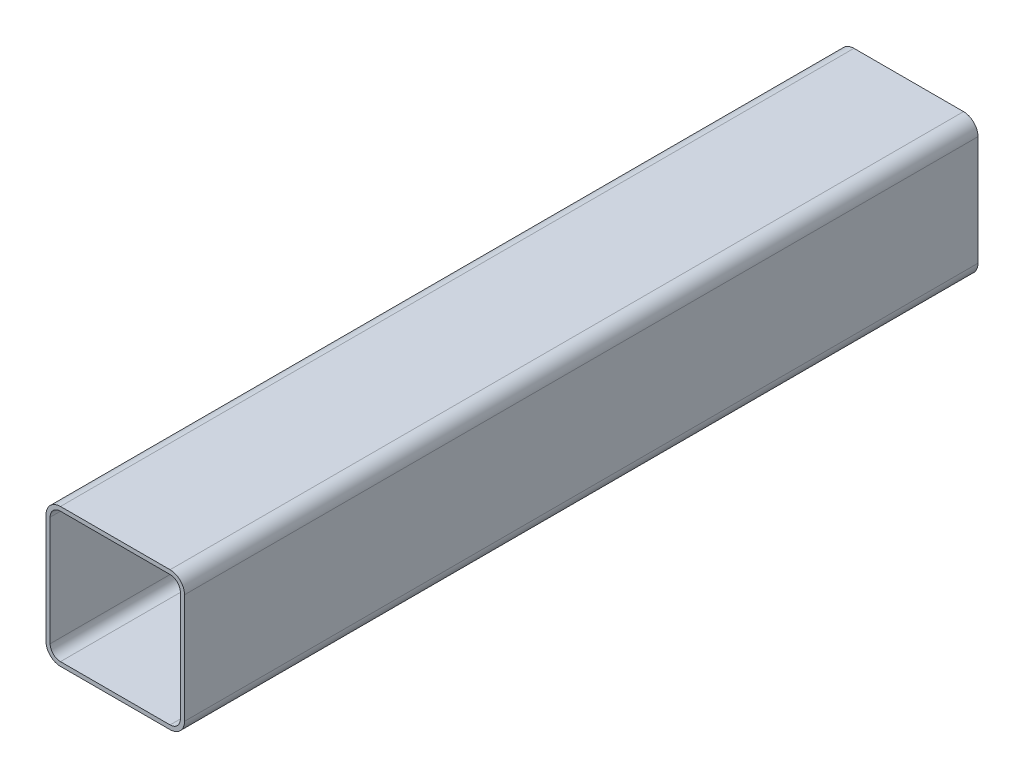
ISO-10303-21;
HEADER;
FILE_DESCRIPTION(('STEP AP214'),'2;1');
FILE_NAME('part.step','',(''),(''),'','','');
FILE_SCHEMA(('AUTOMOTIVE_DESIGN { 1 0 10303 214 1 1 1 1 }'));
ENDSEC;
DATA;
#1=APPLICATION_CONTEXT('core data for automotive mechanical design processes');
#2=APPLICATION_PROTOCOL_DEFINITION('international standard','automotive_design',2000,#1);
#3=PRODUCT_CONTEXT('',#1,'mechanical');
#4=PRODUCT('Part','Part','',(#3));
#5=PRODUCT_RELATED_PRODUCT_CATEGORY('part','',(#4));
#6=PRODUCT_DEFINITION_FORMATION('','',#4);
#7=PRODUCT_DEFINITION_CONTEXT('part definition',#1,'design');
#8=PRODUCT_DEFINITION('design','',#6,#7);
#9=PRODUCT_DEFINITION_SHAPE('','',#8);
#10=(LENGTH_UNIT() NAMED_UNIT(*) SI_UNIT(.MILLI.,.METRE.));
#11=(NAMED_UNIT(*) PLANE_ANGLE_UNIT() SI_UNIT($,.RADIAN.));
#12=(NAMED_UNIT(*) SI_UNIT($,.STERADIAN.) SOLID_ANGLE_UNIT());
#13=UNCERTAINTY_MEASURE_WITH_UNIT(LENGTH_MEASURE(1.E-05),#10,'distance_accuracy_value','');
#14=(GEOMETRIC_REPRESENTATION_CONTEXT(3) GLOBAL_UNCERTAINTY_ASSIGNED_CONTEXT((#13)) GLOBAL_UNIT_ASSIGNED_CONTEXT((#10,
#11,#12)) REPRESENTATION_CONTEXT('',''));
#15=CARTESIAN_POINT('',(0.,0.,0.));
#16=DIRECTION('',(0.,0.,1.));
#17=DIRECTION('',(1.,0.,0.));
#18=AXIS2_PLACEMENT_3D('',#15,#16,#17);
#19=CARTESIAN_POINT('',(-26.6065,-21.05025,152.4));
#20=DIRECTION('',(1.,0.,0.));
#21=DIRECTION('',(0.,0.,-1.));
#22=AXIS2_PLACEMENT_3D('',#19,#20,#21);
#23=PLANE('',#22);
#24=DIRECTION('',(0.,0.,-1.));
#25=VECTOR('',#24,1.);
#26=CARTESIAN_POINT('',(-26.6065,-21.05025,152.4));
#27=LINE('',#26,#25);
#28=CARTESIAN_POINT('',(-26.6065,-21.05025,152.4));
#29=VERTEX_POINT('',#28);
#30=CARTESIAN_POINT('',(-26.6065,-21.05025,-152.4));
#31=VERTEX_POINT('',#30);
#32=EDGE_CURVE('E156',#29,#31,#27,.T.);
#33=ORIENTED_EDGE('',*,*,#32,.F.);
#34=DIRECTION('',(0.,1.,0.));
#35=VECTOR('',#34,1.);
#36=CARTESIAN_POINT('',(-26.6065,21.05025,152.4));
#37=LINE('',#36,#35);
#38=CARTESIAN_POINT('',(-26.6065,21.05025,152.4));
#39=VERTEX_POINT('',#38);
#40=EDGE_CURVE('E116',#39,#29,#37,.F.);
#41=ORIENTED_EDGE('',*,*,#40,.F.);
#42=DIRECTION('',(0.,0.,-1.));
#43=VECTOR('',#42,1.);
#44=CARTESIAN_POINT('',(-26.6065,21.05025,152.4));
#45=LINE('',#44,#43);
#46=CARTESIAN_POINT('',(-26.6065,21.05025,-152.4));
#47=VERTEX_POINT('',#46);
#48=EDGE_CURVE('E159',#47,#39,#45,.F.);
#49=ORIENTED_EDGE('',*,*,#48,.F.);
#50=DIRECTION('',(0.,1.,0.));
#51=VECTOR('',#50,1.);
#52=CARTESIAN_POINT('',(-26.6065,21.05025,-152.4));
#53=LINE('',#52,#51);
#54=EDGE_CURVE('E188',#47,#31,#53,.F.);
#55=ORIENTED_EDGE('',*,*,#54,.T.);
#56=EDGE_LOOP('',(#33,#41,#49,#55));
#57=FACE_BOUND('',#56,.T.);
#58=ADVANCED_FACE('F15',(#57),#23,.F.);
#59=CARTESIAN_POINT('',(-21.05025,-21.05025,152.4));
#60=DIRECTION('',(0.,0.,-1.));
#61=DIRECTION('',(-1.,0.,0.));
#62=AXIS2_PLACEMENT_3D('',#59,#60,#61);
#63=CYLINDRICAL_SURFACE('',#62,5.55625);
#64=CARTESIAN_POINT('',(-21.05025,-21.05025,152.4));
#65=DIRECTION('',(0.,0.,-1.));
#66=DIRECTION('',(-1.,0.,0.));
#67=AXIS2_PLACEMENT_3D('',#64,#65,#66);
#68=CIRCLE('',#67,5.55625);
#69=CARTESIAN_POINT('',(-21.05025,-26.6065,152.4));
#70=VERTEX_POINT('',#69);
#71=EDGE_CURVE('E117',#29,#70,#68,.F.);
#72=ORIENTED_EDGE('',*,*,#71,.F.);
#73=ORIENTED_EDGE('',*,*,#32,.T.);
#74=CARTESIAN_POINT('',(-21.05025,-21.05025,-152.4));
#75=DIRECTION('',(0.,0.,-1.));
#76=DIRECTION('',(-1.,0.,0.));
#77=AXIS2_PLACEMENT_3D('',#74,#75,#76);
#78=CIRCLE('',#77,5.55625);
#79=CARTESIAN_POINT('',(-21.05025,-26.6065,-152.4));
#80=VERTEX_POINT('',#79);
#81=EDGE_CURVE('E185',#31,#80,#78,.F.);
#82=ORIENTED_EDGE('',*,*,#81,.T.);
#83=DIRECTION('',(0.,0.,1.));
#84=VECTOR('',#83,1.);
#85=CARTESIAN_POINT('',(-21.05025,-26.6065,152.4));
#86=LINE('',#85,#84);
#87=EDGE_CURVE('E153',#80,#70,#86,.T.);
#88=ORIENTED_EDGE('',*,*,#87,.T.);
#89=EDGE_LOOP('',(#72,#73,#82,#88));
#90=FACE_BOUND('',#89,.T.);
#91=ADVANCED_FACE('F277',(#90),#63,.T.);
#92=CARTESIAN_POINT('',(-21.05025,-26.6065,152.4));
#93=DIRECTION('',(0.,1.,0.));
#94=DIRECTION('',(0.,0.,1.));
#95=AXIS2_PLACEMENT_3D('',#92,#93,#94);
#96=PLANE('',#95);
#97=DIRECTION('',(0.,0.,-1.));
#98=VECTOR('',#97,1.);
#99=CARTESIAN_POINT('',(21.05025,-26.6065,152.4));
#100=LINE('',#99,#98);
#101=CARTESIAN_POINT('',(21.05025,-26.6065,152.4));
#102=VERTEX_POINT('',#101);
#103=CARTESIAN_POINT('',(21.05025,-26.6065,-152.4));
#104=VERTEX_POINT('',#103);
#105=EDGE_CURVE('E150',#102,#104,#100,.T.);
#106=ORIENTED_EDGE('',*,*,#105,.F.);
#107=DIRECTION('',(1.,0.,0.));
#108=VECTOR('',#107,1.);
#109=CARTESIAN_POINT('',(21.05025,-26.6065,152.4));
#110=LINE('',#109,#108);
#111=EDGE_CURVE('E122',#70,#102,#110,.T.);
#112=ORIENTED_EDGE('',*,*,#111,.F.);
#113=ORIENTED_EDGE('',*,*,#87,.F.);
#114=DIRECTION('',(1.,0.,0.));
#115=VECTOR('',#114,1.);
#116=CARTESIAN_POINT('',(21.05025,-26.6065,-152.4));
#117=LINE('',#116,#115);
#118=EDGE_CURVE('E184',#80,#104,#117,.T.);
#119=ORIENTED_EDGE('',*,*,#118,.T.);
#120=EDGE_LOOP('',(#106,#112,#113,#119));
#121=FACE_BOUND('',#120,.T.);
#122=ADVANCED_FACE('F209',(#121),#96,.F.);
#123=CARTESIAN_POINT('',(21.05025,-21.05025,152.4));
#124=DIRECTION('',(0.,0.,-1.));
#125=DIRECTION('',(-1.,0.,0.));
#126=AXIS2_PLACEMENT_3D('',#123,#124,#125);
#127=CYLINDRICAL_SURFACE('',#126,5.55625);
#128=CARTESIAN_POINT('',(21.05025,-21.05025,152.4));
#129=DIRECTION('',(0.,0.,-1.));
#130=DIRECTION('',(-1.,0.,0.));
#131=AXIS2_PLACEMENT_3D('',#128,#129,#130);
#132=CIRCLE('',#131,5.55625);
#133=CARTESIAN_POINT('',(26.6065,-21.05025,152.4));
#134=VERTEX_POINT('',#133);
#135=EDGE_CURVE('E108',#102,#134,#132,.F.);
#136=ORIENTED_EDGE('',*,*,#135,.F.);
#137=ORIENTED_EDGE('',*,*,#105,.T.);
#138=CARTESIAN_POINT('',(21.05025,-21.05025,-152.4));
#139=DIRECTION('',(0.,0.,-1.));
#140=DIRECTION('',(-1.,0.,0.));
#141=AXIS2_PLACEMENT_3D('',#138,#139,#140);
#142=CIRCLE('',#141,5.55625);
#143=CARTESIAN_POINT('',(26.6065,-21.05025,-152.4));
#144=VERTEX_POINT('',#143);
#145=EDGE_CURVE('E181',#104,#144,#142,.F.);
#146=ORIENTED_EDGE('',*,*,#145,.T.);
#147=DIRECTION('',(0.,0.,1.));
#148=VECTOR('',#147,1.);
#149=CARTESIAN_POINT('',(26.6065,-21.05025,152.4));
#150=LINE('',#149,#148);
#151=EDGE_CURVE('E147',#144,#134,#150,.T.);
#152=ORIENTED_EDGE('',*,*,#151,.T.);
#153=EDGE_LOOP('',(#136,#137,#146,#152));
#154=FACE_BOUND('',#153,.T.);
#155=ADVANCED_FACE('F214',(#154),#127,.T.);
#156=CARTESIAN_POINT('',(26.6065,21.05025,152.4));
#157=DIRECTION('',(-1.,0.,0.));
#158=DIRECTION('',(0.,0.,1.));
#159=AXIS2_PLACEMENT_3D('',#156,#157,#158);
#160=PLANE('',#159);
#161=DIRECTION('',(0.,0.,-1.));
#162=VECTOR('',#161,1.);
#163=CARTESIAN_POINT('',(26.6065,21.05025,152.4));
#164=LINE('',#163,#162);
#165=CARTESIAN_POINT('',(26.6065,21.05025,152.4));
#166=VERTEX_POINT('',#165);
#167=CARTESIAN_POINT('',(26.6065,21.05025,-152.4));
#168=VERTEX_POINT('',#167);
#169=EDGE_CURVE('E88',#166,#168,#164,.T.);
#170=ORIENTED_EDGE('',*,*,#169,.F.);
#171=DIRECTION('',(0.,1.,0.));
#172=VECTOR('',#171,1.);
#173=CARTESIAN_POINT('',(26.6065,21.05025,152.4));
#174=LINE('',#173,#172);
#175=EDGE_CURVE('E92',#134,#166,#174,.T.);
#176=ORIENTED_EDGE('',*,*,#175,.F.);
#177=ORIENTED_EDGE('',*,*,#151,.F.);
#178=DIRECTION('',(0.,1.,0.));
#179=VECTOR('',#178,1.);
#180=CARTESIAN_POINT('',(26.6065,21.05025,-152.4));
#181=LINE('',#180,#179);
#182=EDGE_CURVE('E95',#144,#168,#181,.T.);
#183=ORIENTED_EDGE('',*,*,#182,.T.);
#184=EDGE_LOOP('',(#170,#176,#177,#183));
#185=FACE_BOUND('',#184,.T.);
#186=ADVANCED_FACE('F90',(#185),#160,.F.);
#187=CARTESIAN_POINT('',(21.05025,25.019,152.4));
#188=DIRECTION('',(0.,-1.,0.));
#189=DIRECTION('',(0.,0.,-1.));
#190=AXIS2_PLACEMENT_3D('',#187,#188,#189);
#191=PLANE('',#190);
#192=DIRECTION('',(1.,0.,0.));
#193=VECTOR('',#192,1.);
#194=CARTESIAN_POINT('',(21.05025,25.019,152.4));
#195=LINE('',#194,#193);
#196=CARTESIAN_POINT('',(-21.05025,25.019,152.4));
#197=VERTEX_POINT('',#196);
#198=CARTESIAN_POINT('',(21.05025,25.019,152.4));
#199=VERTEX_POINT('',#198);
#200=EDGE_CURVE('E199',#197,#199,#195,.T.);
#201=ORIENTED_EDGE('',*,*,#200,.F.);
#202=DIRECTION('',(0.,0.,-1.));
#203=VECTOR('',#202,1.);
#204=CARTESIAN_POINT('',(-21.05025,25.019,152.4));
#205=LINE('',#204,#203);
#206=CARTESIAN_POINT('',(-21.05025,25.019,-152.4));
#207=VERTEX_POINT('',#206);
#208=EDGE_CURVE('E100',#197,#207,#205,.T.);
#209=ORIENTED_EDGE('',*,*,#208,.T.);
#210=DIRECTION('',(1.,0.,0.));
#211=VECTOR('',#210,1.);
#212=CARTESIAN_POINT('',(21.05025,25.019,-152.4));
#213=LINE('',#212,#211);
#214=CARTESIAN_POINT('',(21.05025,25.019,-152.4));
#215=VERTEX_POINT('',#214);
#216=EDGE_CURVE('E178',#207,#215,#213,.T.);
#217=ORIENTED_EDGE('',*,*,#216,.T.);
#218=DIRECTION('',(0.,0.,-1.));
#219=VECTOR('',#218,1.);
#220=CARTESIAN_POINT('',(21.05025,25.019,152.4));
#221=LINE('',#220,#219);
#222=EDGE_CURVE('E145',#215,#199,#221,.F.);
#223=ORIENTED_EDGE('',*,*,#222,.T.);
#224=EDGE_LOOP('',(#201,#209,#217,#223));
#225=FACE_BOUND('',#224,.T.);
#226=ADVANCED_FACE('F250',(#225),#191,.T.);
#227=CARTESIAN_POINT('',(21.05025,21.05025,152.4));
#228=DIRECTION('',(0.,0.,-1.));
#229=DIRECTION('',(-1.,0.,0.));
#230=AXIS2_PLACEMENT_3D('',#227,#228,#229);
#231=CYLINDRICAL_SURFACE('',#230,3.96875);
#232=DIRECTION('',(0.,0.,1.));
#233=VECTOR('',#232,1.);
#234=CARTESIAN_POINT('',(25.019,21.05025,152.4));
#235=LINE('',#234,#233);
#236=CARTESIAN_POINT('',(25.019,21.05025,152.4));
#237=VERTEX_POINT('',#236);
#238=CARTESIAN_POINT('',(25.019,21.05025,-152.4));
#239=VERTEX_POINT('',#238);
#240=EDGE_CURVE('E142',#237,#239,#235,.F.);
#241=ORIENTED_EDGE('',*,*,#240,.F.);
#242=CARTESIAN_POINT('',(21.05025,21.05025,152.4));
#243=DIRECTION('',(0.,0.,-1.));
#244=DIRECTION('',(-1.,0.,0.));
#245=AXIS2_PLACEMENT_3D('',#242,#243,#244);
#246=CIRCLE('',#245,3.96875);
#247=EDGE_CURVE('E197',#199,#237,#246,.T.);
#248=ORIENTED_EDGE('',*,*,#247,.F.);
#249=ORIENTED_EDGE('',*,*,#222,.F.);
#250=CARTESIAN_POINT('',(21.05025,21.05025,-152.4));
#251=DIRECTION('',(0.,0.,-1.));
#252=DIRECTION('',(-1.,0.,0.));
#253=AXIS2_PLACEMENT_3D('',#250,#251,#252);
#254=CIRCLE('',#253,3.96875);
#255=EDGE_CURVE('E175',#215,#239,#254,.T.);
#256=ORIENTED_EDGE('',*,*,#255,.T.);
#257=EDGE_LOOP('',(#241,#248,#249,#256));
#258=FACE_BOUND('',#257,.T.);
#259=ADVANCED_FACE('F323',(#258),#231,.F.);
#260=CARTESIAN_POINT('',(25.019,21.05025,152.4));
#261=DIRECTION('',(-1.,0.,0.));
#262=DIRECTION('',(0.,0.,1.));
#263=AXIS2_PLACEMENT_3D('',#260,#261,#262);
#264=PLANE('',#263);
#265=DIRECTION('',(0.,1.,0.));
#266=VECTOR('',#265,1.);
#267=CARTESIAN_POINT('',(25.019,21.05025,152.4));
#268=LINE('',#267,#266);
#269=CARTESIAN_POINT('',(25.019,-21.05025,152.4));
#270=VERTEX_POINT('',#269);
#271=EDGE_CURVE('E196',#237,#270,#268,.F.);
#272=ORIENTED_EDGE('',*,*,#271,.F.);
#273=ORIENTED_EDGE('',*,*,#240,.T.);
#274=DIRECTION('',(0.,1.,0.));
#275=VECTOR('',#274,1.);
#276=CARTESIAN_POINT('',(25.019,21.05025,-152.4));
#277=LINE('',#276,#275);
#278=CARTESIAN_POINT('',(25.019,-21.05025,-152.4));
#279=VERTEX_POINT('',#278);
#280=EDGE_CURVE('E174',#239,#279,#277,.F.);
#281=ORIENTED_EDGE('',*,*,#280,.T.);
#282=DIRECTION('',(0.,0.,-1.));
#283=VECTOR('',#282,1.);
#284=CARTESIAN_POINT('',(25.019,-21.05025,152.4));
#285=LINE('',#284,#283);
#286=EDGE_CURVE('E139',#279,#270,#285,.F.);
#287=ORIENTED_EDGE('',*,*,#286,.T.);
#288=EDGE_LOOP('',(#272,#273,#281,#287));
#289=FACE_BOUND('',#288,.T.);
#290=ADVANCED_FACE('F319',(#289),#264,.T.);
#291=CARTESIAN_POINT('',(21.05025,-21.05025,152.4));
#292=DIRECTION('',(0.,0.,-1.));
#293=DIRECTION('',(-1.,0.,0.));
#294=AXIS2_PLACEMENT_3D('',#291,#292,#293);
#295=CYLINDRICAL_SURFACE('',#294,3.96875);
#296=DIRECTION('',(0.,0.,1.));
#297=VECTOR('',#296,1.);
#298=CARTESIAN_POINT('',(21.05025,-25.019,152.4));
#299=LINE('',#298,#297);
#300=CARTESIAN_POINT('',(21.05025,-25.019,152.4));
#301=VERTEX_POINT('',#300);
#302=CARTESIAN_POINT('',(21.05025,-25.019,-152.4));
#303=VERTEX_POINT('',#302);
#304=EDGE_CURVE('E136',#301,#303,#299,.F.);
#305=ORIENTED_EDGE('',*,*,#304,.F.);
#306=CARTESIAN_POINT('',(21.05025,-21.05025,152.4));
#307=DIRECTION('',(0.,0.,-1.));
#308=DIRECTION('',(-1.,0.,0.));
#309=AXIS2_PLACEMENT_3D('',#306,#307,#308);
#310=CIRCLE('',#309,3.96875);
#311=EDGE_CURVE('E194',#270,#301,#310,.T.);
#312=ORIENTED_EDGE('',*,*,#311,.F.);
#313=ORIENTED_EDGE('',*,*,#286,.F.);
#314=CARTESIAN_POINT('',(21.05025,-21.05025,-152.4));
#315=DIRECTION('',(0.,0.,-1.));
#316=DIRECTION('',(-1.,0.,0.));
#317=AXIS2_PLACEMENT_3D('',#314,#315,#316);
#318=CIRCLE('',#317,3.96875);
#319=EDGE_CURVE('E171',#279,#303,#318,.T.);
#320=ORIENTED_EDGE('',*,*,#319,.T.);
#321=EDGE_LOOP('',(#305,#312,#313,#320));
#322=FACE_BOUND('',#321,.T.);
#323=ADVANCED_FACE('F315',(#322),#295,.F.);
#324=CARTESIAN_POINT('',(-21.05025,-25.019,152.4));
#325=DIRECTION('',(0.,1.,0.));
#326=DIRECTION('',(0.,0.,1.));
#327=AXIS2_PLACEMENT_3D('',#324,#325,#326);
#328=PLANE('',#327);
#329=DIRECTION('',(1.,0.,0.));
#330=VECTOR('',#329,1.);
#331=CARTESIAN_POINT('',(21.05025,-25.019,152.4));
#332=LINE('',#331,#330);
#333=CARTESIAN_POINT('',(-21.05025,-25.019,152.4));
#334=VERTEX_POINT('',#333);
#335=EDGE_CURVE('E193',#301,#334,#332,.F.);
#336=ORIENTED_EDGE('',*,*,#335,.F.);
#337=ORIENTED_EDGE('',*,*,#304,.T.);
#338=DIRECTION('',(1.,0.,0.));
#339=VECTOR('',#338,1.);
#340=CARTESIAN_POINT('',(21.05025,-25.019,-152.4));
#341=LINE('',#340,#339);
#342=CARTESIAN_POINT('',(-21.05025,-25.019,-152.4));
#343=VERTEX_POINT('',#342);
#344=EDGE_CURVE('E170',#303,#343,#341,.F.);
#345=ORIENTED_EDGE('',*,*,#344,.T.);
#346=DIRECTION('',(0.,0.,-1.));
#347=VECTOR('',#346,1.);
#348=CARTESIAN_POINT('',(-21.05025,-25.019,152.4));
#349=LINE('',#348,#347);
#350=EDGE_CURVE('E133',#343,#334,#349,.F.);
#351=ORIENTED_EDGE('',*,*,#350,.T.);
#352=EDGE_LOOP('',(#336,#337,#345,#351));
#353=FACE_BOUND('',#352,.T.);
#354=ADVANCED_FACE('F311',(#353),#328,.T.);
#355=CARTESIAN_POINT('',(-21.05025,-21.05025,152.4));
#356=DIRECTION('',(0.,0.,-1.));
#357=DIRECTION('',(-1.,0.,0.));
#358=AXIS2_PLACEMENT_3D('',#355,#356,#357);
#359=CYLINDRICAL_SURFACE('',#358,3.96875);
#360=DIRECTION('',(0.,0.,-1.));
#361=VECTOR('',#360,1.);
#362=CARTESIAN_POINT('',(-25.019,-21.05025,152.4));
#363=LINE('',#362,#361);
#364=CARTESIAN_POINT('',(-25.019,-21.05025,152.4));
#365=VERTEX_POINT('',#364);
#366=CARTESIAN_POINT('',(-25.019,-21.05025,-152.4));
#367=VERTEX_POINT('',#366);
#368=EDGE_CURVE('E130',#365,#367,#363,.T.);
#369=ORIENTED_EDGE('',*,*,#368,.F.);
#370=CARTESIAN_POINT('',(-21.05025,-21.05025,152.4));
#371=DIRECTION('',(0.,0.,-1.));
#372=DIRECTION('',(-1.,0.,0.));
#373=AXIS2_PLACEMENT_3D('',#370,#371,#372);
#374=CIRCLE('',#373,3.96875);
#375=EDGE_CURVE('E162',#334,#365,#374,.T.);
#376=ORIENTED_EDGE('',*,*,#375,.F.);
#377=ORIENTED_EDGE('',*,*,#350,.F.);
#378=CARTESIAN_POINT('',(-21.05025,-21.05025,-152.4));
#379=DIRECTION('',(0.,0.,-1.));
#380=DIRECTION('',(-1.,0.,0.));
#381=AXIS2_PLACEMENT_3D('',#378,#379,#380);
#382=CIRCLE('',#381,3.96875);
#383=EDGE_CURVE('E167',#343,#367,#382,.T.);
#384=ORIENTED_EDGE('',*,*,#383,.T.);
#385=EDGE_LOOP('',(#369,#376,#377,#384));
#386=FACE_BOUND('',#385,.T.);
#387=ADVANCED_FACE('F308',(#386),#359,.F.);
#388=CARTESIAN_POINT('',(-25.019,-21.05025,152.4));
#389=DIRECTION('',(1.,0.,0.));
#390=DIRECTION('',(0.,0.,-1.));
#391=AXIS2_PLACEMENT_3D('',#388,#389,#390);
#392=PLANE('',#391);
#393=DIRECTION('',(0.,1.,0.));
#394=VECTOR('',#393,1.);
#395=CARTESIAN_POINT('',(-25.019,21.05025,152.4));
#396=LINE('',#395,#394);
#397=CARTESIAN_POINT('',(-25.019,21.05025,152.4));
#398=VERTEX_POINT('',#397);
#399=EDGE_CURVE('E110',#365,#398,#396,.T.);
#400=ORIENTED_EDGE('',*,*,#399,.F.);
#401=ORIENTED_EDGE('',*,*,#368,.T.);
#402=DIRECTION('',(0.,1.,0.));
#403=VECTOR('',#402,1.);
#404=CARTESIAN_POINT('',(-25.019,21.05025,-152.4));
#405=LINE('',#404,#403);
#406=CARTESIAN_POINT('',(-25.019,21.05025,-152.4));
#407=VERTEX_POINT('',#406);
#408=EDGE_CURVE('E166',#367,#407,#405,.T.);
#409=ORIENTED_EDGE('',*,*,#408,.T.);
#410=DIRECTION('',(0.,0.,-1.));
#411=VECTOR('',#410,1.);
#412=CARTESIAN_POINT('',(-25.019,21.05025,152.4));
#413=LINE('',#412,#411);
#414=EDGE_CURVE('E127',#407,#398,#413,.F.);
#415=ORIENTED_EDGE('',*,*,#414,.T.);
#416=EDGE_LOOP('',(#400,#401,#409,#415));
#417=FACE_BOUND('',#416,.T.);
#418=ADVANCED_FACE('F241',(#417),#392,.T.);
#419=CARTESIAN_POINT('',(-21.05025,21.05025,152.4));
#420=DIRECTION('',(0.,0.,-1.));
#421=DIRECTION('',(-1.,0.,0.));
#422=AXIS2_PLACEMENT_3D('',#419,#420,#421);
#423=CYLINDRICAL_SURFACE('',#422,3.96875);
#424=ORIENTED_EDGE('',*,*,#208,.F.);
#425=CARTESIAN_POINT('',(-21.05025,21.05025,152.4));
#426=DIRECTION('',(0.,0.,-1.));
#427=DIRECTION('',(-1.,0.,0.));
#428=AXIS2_PLACEMENT_3D('',#425,#426,#427);
#429=CIRCLE('',#428,3.96875);
#430=EDGE_CURVE('E200',#398,#197,#429,.T.);
#431=ORIENTED_EDGE('',*,*,#430,.F.);
#432=ORIENTED_EDGE('',*,*,#414,.F.);
#433=CARTESIAN_POINT('',(-21.05025,21.05025,-152.4));
#434=DIRECTION('',(0.,0.,-1.));
#435=DIRECTION('',(-1.,0.,0.));
#436=AXIS2_PLACEMENT_3D('',#433,#434,#435);
#437=CIRCLE('',#436,3.96875);
#438=EDGE_CURVE('E163',#407,#207,#437,.T.);
#439=ORIENTED_EDGE('',*,*,#438,.T.);
#440=EDGE_LOOP('',(#424,#431,#432,#439));
#441=FACE_BOUND('',#440,.T.);
#442=ADVANCED_FACE('F246',(#441),#423,.F.);
#443=CARTESIAN_POINT('',(21.05025,21.05025,152.4));
#444=DIRECTION('',(0.,0.,-1.));
#445=DIRECTION('',(-1.,0.,0.));
#446=AXIS2_PLACEMENT_3D('',#443,#444,#445);
#447=CYLINDRICAL_SURFACE('',#446,5.55625);
#448=CARTESIAN_POINT('',(21.05025,21.05025,152.4));
#449=DIRECTION('',(0.,0.,-1.));
#450=DIRECTION('',(-1.,0.,0.));
#451=AXIS2_PLACEMENT_3D('',#448,#449,#450);
#452=CIRCLE('',#451,5.55625);
#453=CARTESIAN_POINT('',(21.05025,26.6065,152.4));
#454=VERTEX_POINT('',#453);
#455=EDGE_CURVE('E18',#166,#454,#452,.F.);
#456=ORIENTED_EDGE('',*,*,#455,.F.);
#457=ORIENTED_EDGE('',*,*,#169,.T.);
#458=CARTESIAN_POINT('',(21.05025,21.05025,-152.4));
#459=DIRECTION('',(0.,0.,-1.));
#460=DIRECTION('',(-1.,0.,0.));
#461=AXIS2_PLACEMENT_3D('',#458,#459,#460);
#462=CIRCLE('',#461,5.55625);
#463=CARTESIAN_POINT('',(21.05025,26.6065,-152.4));
#464=VERTEX_POINT('',#463);
#465=EDGE_CURVE('E179',#168,#464,#462,.F.);
#466=ORIENTED_EDGE('',*,*,#465,.T.);
#467=DIRECTION('',(0.,0.,-1.));
#468=VECTOR('',#467,1.);
#469=CARTESIAN_POINT('',(21.05025,26.6065,152.4));
#470=LINE('',#469,#468);
#471=EDGE_CURVE('E115',#464,#454,#470,.F.);
#472=ORIENTED_EDGE('',*,*,#471,.T.);
#473=EDGE_LOOP('',(#456,#457,#466,#472));
#474=FACE_BOUND('',#473,.T.);
#475=ADVANCED_FACE('F113',(#474),#447,.T.);
#476=CARTESIAN_POINT('',(21.05025,21.05025,152.4));
#477=DIRECTION('',(0.,0.,1.));
#478=DIRECTION('',(1.,0.,0.));
#479=AXIS2_PLACEMENT_3D('',#476,#477,#478);
#480=PLANE('',#479);
#481=ORIENTED_EDGE('',*,*,#335,.T.);
#482=ORIENTED_EDGE('',*,*,#375,.T.);
#483=ORIENTED_EDGE('',*,*,#399,.T.);
#484=ORIENTED_EDGE('',*,*,#430,.T.);
#485=ORIENTED_EDGE('',*,*,#200,.T.);
#486=ORIENTED_EDGE('',*,*,#247,.T.);
#487=ORIENTED_EDGE('',*,*,#271,.T.);
#488=ORIENTED_EDGE('',*,*,#311,.T.);
#489=EDGE_LOOP('',(#481,#482,#483,#484,#485,#486,#487,#488));
#490=FACE_BOUND('',#489,.T.);
#491=ORIENTED_EDGE('',*,*,#135,.T.);
#492=ORIENTED_EDGE('',*,*,#175,.T.);
#493=ORIENTED_EDGE('',*,*,#455,.T.);
#494=DIRECTION('',(1.,0.,0.));
#495=VECTOR('',#494,1.);
#496=CARTESIAN_POINT('',(21.05025,26.6065,152.4));
#497=LINE('',#496,#495);
#498=CARTESIAN_POINT('',(-21.05025,26.6065,152.4));
#499=VERTEX_POINT('',#498);
#500=EDGE_CURVE('E226',#454,#499,#497,.F.);
#501=ORIENTED_EDGE('',*,*,#500,.T.);
#502=CARTESIAN_POINT('',(-21.05025,21.05025,152.4));
#503=DIRECTION('',(0.,0.,-1.));
#504=DIRECTION('',(-1.,0.,0.));
#505=AXIS2_PLACEMENT_3D('',#502,#503,#504);
#506=CIRCLE('',#505,5.55625);
#507=EDGE_CURVE('E161',#39,#499,#506,.T.);
#508=ORIENTED_EDGE('',*,*,#507,.F.);
#509=ORIENTED_EDGE('',*,*,#40,.T.);
#510=ORIENTED_EDGE('',*,*,#71,.T.);
#511=ORIENTED_EDGE('',*,*,#111,.T.);
#512=EDGE_LOOP('',(#491,#492,#493,#501,#508,#509,#510,#511));
#513=FACE_BOUND('',#512,.T.);
#514=ADVANCED_FACE('F104',(#490,#513),#480,.T.);
#515=CARTESIAN_POINT('',(-21.05025,21.05025,152.4));
#516=DIRECTION('',(0.,0.,-1.));
#517=DIRECTION('',(-1.,0.,0.));
#518=AXIS2_PLACEMENT_3D('',#515,#516,#517);
#519=CYLINDRICAL_SURFACE('',#518,5.55625);
#520=ORIENTED_EDGE('',*,*,#507,.T.);
#521=DIRECTION('',(0.,0.,-1.));
#522=VECTOR('',#521,1.);
#523=CARTESIAN_POINT('',(-21.05025,26.6065,152.4));
#524=LINE('',#523,#522);
#525=CARTESIAN_POINT('',(-21.05025,26.6065,-152.4));
#526=VERTEX_POINT('',#525);
#527=EDGE_CURVE('E24',#499,#526,#524,.T.);
#528=ORIENTED_EDGE('',*,*,#527,.T.);
#529=CARTESIAN_POINT('',(-21.05025,21.05025,-152.4));
#530=DIRECTION('',(0.,0.,-1.));
#531=DIRECTION('',(-1.,0.,0.));
#532=AXIS2_PLACEMENT_3D('',#529,#530,#531);
#533=CIRCLE('',#532,5.55625);
#534=EDGE_CURVE('E32',#526,#47,#533,.F.);
#535=ORIENTED_EDGE('',*,*,#534,.T.);
#536=ORIENTED_EDGE('',*,*,#48,.T.);
#537=EDGE_LOOP('',(#520,#528,#535,#536));
#538=FACE_BOUND('',#537,.T.);
#539=ADVANCED_FACE('F293',(#538),#519,.T.);
#540=CARTESIAN_POINT('',(21.05025,21.05025,-152.4));
#541=DIRECTION('',(0.,0.,1.));
#542=DIRECTION('',(1.,0.,0.));
#543=AXIS2_PLACEMENT_3D('',#540,#541,#542);
#544=PLANE('',#543);
#545=ORIENTED_EDGE('',*,*,#408,.F.);
#546=ORIENTED_EDGE('',*,*,#383,.F.);
#547=ORIENTED_EDGE('',*,*,#344,.F.);
#548=ORIENTED_EDGE('',*,*,#319,.F.);
#549=ORIENTED_EDGE('',*,*,#280,.F.);
#550=ORIENTED_EDGE('',*,*,#255,.F.);
#551=ORIENTED_EDGE('',*,*,#216,.F.);
#552=ORIENTED_EDGE('',*,*,#438,.F.);
#553=EDGE_LOOP('',(#545,#546,#547,#548,#549,#550,#551,#552));
#554=FACE_BOUND('',#553,.T.);
#555=ORIENTED_EDGE('',*,*,#182,.F.);
#556=ORIENTED_EDGE('',*,*,#145,.F.);
#557=ORIENTED_EDGE('',*,*,#118,.F.);
#558=ORIENTED_EDGE('',*,*,#81,.F.);
#559=ORIENTED_EDGE('',*,*,#54,.F.);
#560=ORIENTED_EDGE('',*,*,#534,.F.);
#561=DIRECTION('',(1.,0.,0.));
#562=VECTOR('',#561,1.);
#563=CARTESIAN_POINT('',(21.05025,26.6065,-152.4));
#564=LINE('',#563,#562);
#565=EDGE_CURVE('E9',#526,#464,#564,.T.);
#566=ORIENTED_EDGE('',*,*,#565,.T.);
#567=ORIENTED_EDGE('',*,*,#465,.F.);
#568=EDGE_LOOP('',(#555,#556,#557,#558,#559,#560,#566,#567));
#569=FACE_BOUND('',#568,.T.);
#570=ADVANCED_FACE('F217',(#554,#569),#544,.F.);
#571=CARTESIAN_POINT('',(21.05025,26.6065,152.4));
#572=DIRECTION('',(0.,-1.,0.));
#573=DIRECTION('',(0.,0.,-1.));
#574=AXIS2_PLACEMENT_3D('',#571,#572,#573);
#575=PLANE('',#574);
#576=ORIENTED_EDGE('',*,*,#527,.F.);
#577=ORIENTED_EDGE('',*,*,#500,.F.);
#578=ORIENTED_EDGE('',*,*,#471,.F.);
#579=ORIENTED_EDGE('',*,*,#565,.F.);
#580=EDGE_LOOP('',(#576,#577,#578,#579));
#581=FACE_BOUND('',#580,.T.);
#582=ADVANCED_FACE('F286',(#581),#575,.F.);
#583=CLOSED_SHELL('',(#58,#91,#122,#155,#186,#226,#259,#290,#323,#354,#387,#418,#442,#475,#514,
#539,#570,#582));
#584=MANIFOLD_SOLID_BREP('B1',#583);
#585=ADVANCED_BREP_SHAPE_REPRESENTATION('',(#18,#584),#14);
#586=SHAPE_DEFINITION_REPRESENTATION(#9,#585);
ENDSEC;
END-ISO-10303-21;
